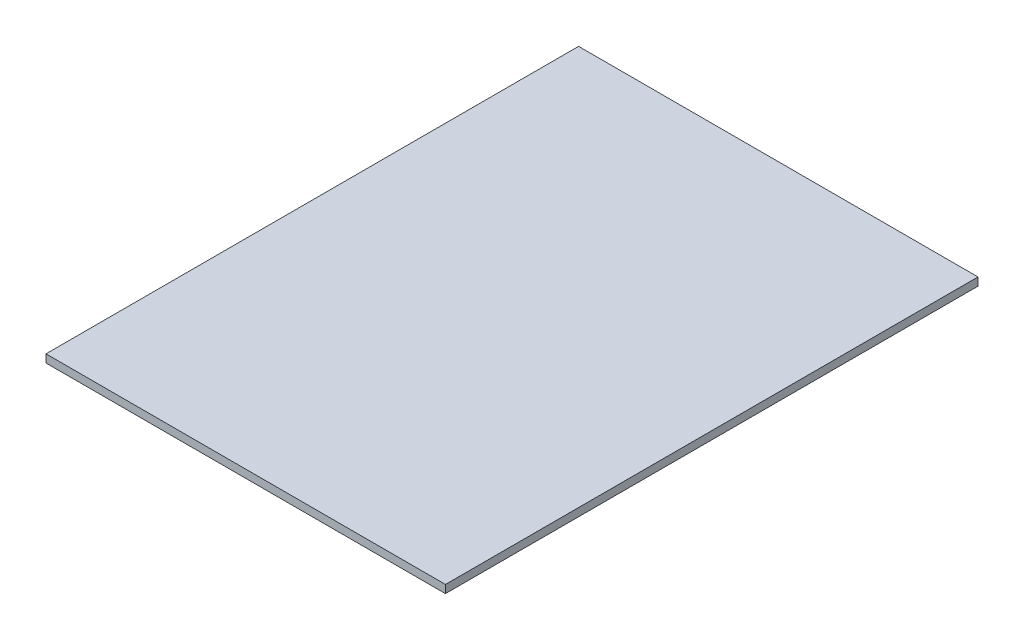
ISO-10303-21;
HEADER;
FILE_DESCRIPTION(('STEP AP214'),'2;1');
FILE_NAME('part.step','',(''),(''),'','','');
FILE_SCHEMA(('AUTOMOTIVE_DESIGN { 1 0 10303 214 1 1 1 1 }'));
ENDSEC;
DATA;
#1=APPLICATION_CONTEXT('core data for automotive mechanical design processes');
#2=APPLICATION_PROTOCOL_DEFINITION('international standard','automotive_design',2000,#1);
#3=PRODUCT_CONTEXT('',#1,'mechanical');
#4=PRODUCT('Part','Part','',(#3));
#5=PRODUCT_RELATED_PRODUCT_CATEGORY('part','',(#4));
#6=PRODUCT_DEFINITION_FORMATION('','',#4);
#7=PRODUCT_DEFINITION_CONTEXT('part definition',#1,'design');
#8=PRODUCT_DEFINITION('design','',#6,#7);
#9=PRODUCT_DEFINITION_SHAPE('','',#8);
#10=(LENGTH_UNIT() NAMED_UNIT(*) SI_UNIT(.MILLI.,.METRE.));
#11=(NAMED_UNIT(*) PLANE_ANGLE_UNIT() SI_UNIT($,.RADIAN.));
#12=(NAMED_UNIT(*) SI_UNIT($,.STERADIAN.) SOLID_ANGLE_UNIT());
#13=UNCERTAINTY_MEASURE_WITH_UNIT(LENGTH_MEASURE(1.E-05),#10,'distance_accuracy_value','');
#14=(GEOMETRIC_REPRESENTATION_CONTEXT(3) GLOBAL_UNCERTAINTY_ASSIGNED_CONTEXT((#13)) GLOBAL_UNIT_ASSIGNED_CONTEXT((#10,
#11,#12)) REPRESENTATION_CONTEXT('',''));
#15=CARTESIAN_POINT('',(0.,0.,0.));
#16=DIRECTION('',(0.,0.,1.));
#17=DIRECTION('',(1.,0.,0.));
#18=AXIS2_PLACEMENT_3D('',#15,#16,#17);
#19=CARTESIAN_POINT('',(75.,3.,-100.));
#20=DIRECTION('',(-1.,0.,0.));
#21=DIRECTION('',(0.,0.,1.));
#22=AXIS2_PLACEMENT_3D('',#19,#20,#21);
#23=PLANE('',#22);
#24=DIRECTION('',(0.,0.,-1.));
#25=VECTOR('',#24,1.);
#26=CARTESIAN_POINT('',(75.,0.,-100.));
#27=LINE('',#26,#25);
#28=CARTESIAN_POINT('',(75.,0.,100.));
#29=VERTEX_POINT('',#28);
#30=CARTESIAN_POINT('',(75.,0.,-100.));
#31=VERTEX_POINT('',#30);
#32=EDGE_CURVE('E100',#29,#31,#27,.T.);
#33=ORIENTED_EDGE('',*,*,#32,.T.);
#34=DIRECTION('',(0.,-1.,0.));
#35=VECTOR('',#34,1.);
#36=CARTESIAN_POINT('',(75.,3.,-100.));
#37=LINE('',#36,#35);
#38=CARTESIAN_POINT('',(75.,3.,-100.));
#39=VERTEX_POINT('',#38);
#40=EDGE_CURVE('E11',#39,#31,#37,.T.);
#41=ORIENTED_EDGE('',*,*,#40,.F.);
#42=DIRECTION('',(0.,0.,-1.));
#43=VECTOR('',#42,1.);
#44=CARTESIAN_POINT('',(75.,3.,-100.));
#45=LINE('',#44,#43);
#46=CARTESIAN_POINT('',(75.,3.,100.));
#47=VERTEX_POINT('',#46);
#48=EDGE_CURVE('E88',#47,#39,#45,.T.);
#49=ORIENTED_EDGE('',*,*,#48,.F.);
#50=DIRECTION('',(0.,-1.,0.));
#51=VECTOR('',#50,1.);
#52=CARTESIAN_POINT('',(75.,3.,100.));
#53=LINE('',#52,#51);
#54=EDGE_CURVE('E96',#47,#29,#53,.T.);
#55=ORIENTED_EDGE('',*,*,#54,.T.);
#56=EDGE_LOOP('',(#33,#41,#49,#55));
#57=FACE_BOUND('',#56,.T.);
#58=ADVANCED_FACE('F37',(#57),#23,.F.);
#59=CARTESIAN_POINT('',(-75.,3.,-100.));
#60=DIRECTION('',(0.,0.,1.));
#61=DIRECTION('',(1.,0.,0.));
#62=AXIS2_PLACEMENT_3D('',#59,#60,#61);
#63=PLANE('',#62);
#64=DIRECTION('',(-1.,0.,0.));
#65=VECTOR('',#64,1.);
#66=CARTESIAN_POINT('',(-75.,0.,-100.));
#67=LINE('',#66,#65);
#68=CARTESIAN_POINT('',(-75.,0.,-100.));
#69=VERTEX_POINT('',#68);
#70=EDGE_CURVE('E92',#31,#69,#67,.T.);
#71=ORIENTED_EDGE('',*,*,#70,.T.);
#72=DIRECTION('',(0.,-1.,0.));
#73=VECTOR('',#72,1.);
#74=CARTESIAN_POINT('',(-75.,3.,-100.));
#75=LINE('',#74,#73);
#76=CARTESIAN_POINT('',(-75.,3.,-100.));
#77=VERTEX_POINT('',#76);
#78=EDGE_CURVE('E45',#77,#69,#75,.T.);
#79=ORIENTED_EDGE('',*,*,#78,.F.);
#80=DIRECTION('',(-1.,0.,0.));
#81=VECTOR('',#80,1.);
#82=CARTESIAN_POINT('',(-75.,3.,-100.));
#83=LINE('',#82,#81);
#84=EDGE_CURVE('E83',#39,#77,#83,.T.);
#85=ORIENTED_EDGE('',*,*,#84,.F.);
#86=ORIENTED_EDGE('',*,*,#40,.T.);
#87=EDGE_LOOP('',(#71,#79,#85,#86));
#88=FACE_BOUND('',#87,.T.);
#89=ADVANCED_FACE('F91',(#88),#63,.F.);
#90=CARTESIAN_POINT('',(-75.,3.,-100.));
#91=DIRECTION('',(1.,0.,0.));
#92=DIRECTION('',(0.,0.,-1.));
#93=AXIS2_PLACEMENT_3D('',#90,#91,#92);
#94=PLANE('',#93);
#95=DIRECTION('',(0.,0.,1.));
#96=VECTOR('',#95,1.);
#97=CARTESIAN_POINT('',(-75.,0.,-100.));
#98=LINE('',#97,#96);
#99=CARTESIAN_POINT('',(-75.,0.,100.));
#100=VERTEX_POINT('',#99);
#101=EDGE_CURVE('E70',#69,#100,#98,.T.);
#102=ORIENTED_EDGE('',*,*,#101,.T.);
#103=DIRECTION('',(0.,-1.,0.));
#104=VECTOR('',#103,1.);
#105=CARTESIAN_POINT('',(-75.,3.,100.));
#106=LINE('',#105,#104);
#107=CARTESIAN_POINT('',(-75.,3.,100.));
#108=VERTEX_POINT('',#107);
#109=EDGE_CURVE('E93',#108,#100,#106,.T.);
#110=ORIENTED_EDGE('',*,*,#109,.F.);
#111=DIRECTION('',(0.,0.,1.));
#112=VECTOR('',#111,1.);
#113=CARTESIAN_POINT('',(-75.,3.,-100.));
#114=LINE('',#113,#112);
#115=EDGE_CURVE('E86',#77,#108,#114,.T.);
#116=ORIENTED_EDGE('',*,*,#115,.F.);
#117=ORIENTED_EDGE('',*,*,#78,.T.);
#118=EDGE_LOOP('',(#102,#110,#116,#117));
#119=FACE_BOUND('',#118,.T.);
#120=ADVANCED_FACE('F94',(#119),#94,.F.);
#121=CARTESIAN_POINT('',(-75.,3.,100.));
#122=DIRECTION('',(0.,0.,-1.));
#123=DIRECTION('',(-1.,0.,0.));
#124=AXIS2_PLACEMENT_3D('',#121,#122,#123);
#125=PLANE('',#124);
#126=DIRECTION('',(1.,0.,0.));
#127=VECTOR('',#126,1.);
#128=CARTESIAN_POINT('',(-75.,0.,100.));
#129=LINE('',#128,#127);
#130=EDGE_CURVE('E76',#100,#29,#129,.T.);
#131=ORIENTED_EDGE('',*,*,#130,.T.);
#132=ORIENTED_EDGE('',*,*,#54,.F.);
#133=DIRECTION('',(1.,0.,0.));
#134=VECTOR('',#133,1.);
#135=CARTESIAN_POINT('',(-75.,3.,100.));
#136=LINE('',#135,#134);
#137=EDGE_CURVE('E53',#108,#47,#136,.T.);
#138=ORIENTED_EDGE('',*,*,#137,.F.);
#139=ORIENTED_EDGE('',*,*,#109,.T.);
#140=EDGE_LOOP('',(#131,#132,#138,#139));
#141=FACE_BOUND('',#140,.T.);
#142=ADVANCED_FACE('F107',(#141),#125,.F.);
#143=CARTESIAN_POINT('',(0.,3.,0.));
#144=DIRECTION('',(0.,1.,0.));
#145=DIRECTION('',(0.,0.,1.));
#146=AXIS2_PLACEMENT_3D('',#143,#144,#145);
#147=PLANE('',#146);
#148=ORIENTED_EDGE('',*,*,#48,.T.);
#149=ORIENTED_EDGE('',*,*,#84,.T.);
#150=ORIENTED_EDGE('',*,*,#115,.T.);
#151=ORIENTED_EDGE('',*,*,#137,.T.);
#152=EDGE_LOOP('',(#148,#149,#150,#151));
#153=FACE_BOUND('',#152,.T.);
#154=ADVANCED_FACE('F84',(#153),#147,.T.);
#155=CARTESIAN_POINT('',(0.,0.,0.));
#156=DIRECTION('',(0.,1.,0.));
#157=DIRECTION('',(0.,0.,1.));
#158=AXIS2_PLACEMENT_3D('',#155,#156,#157);
#159=PLANE('',#158);
#160=ORIENTED_EDGE('',*,*,#32,.F.);
#161=ORIENTED_EDGE('',*,*,#130,.F.);
#162=ORIENTED_EDGE('',*,*,#101,.F.);
#163=ORIENTED_EDGE('',*,*,#70,.F.);
#164=EDGE_LOOP('',(#160,#161,#162,#163));
#165=FACE_BOUND('',#164,.T.);
#166=ADVANCED_FACE('F110',(#165),#159,.F.);
#167=CLOSED_SHELL('',(#58,#89,#120,#142,#154,#166));
#168=MANIFOLD_SOLID_BREP('B2',#167);
#169=ADVANCED_BREP_SHAPE_REPRESENTATION('',(#18,#168),#14);
#170=SHAPE_DEFINITION_REPRESENTATION(#9,#169);
ENDSEC;
END-ISO-10303-21;
